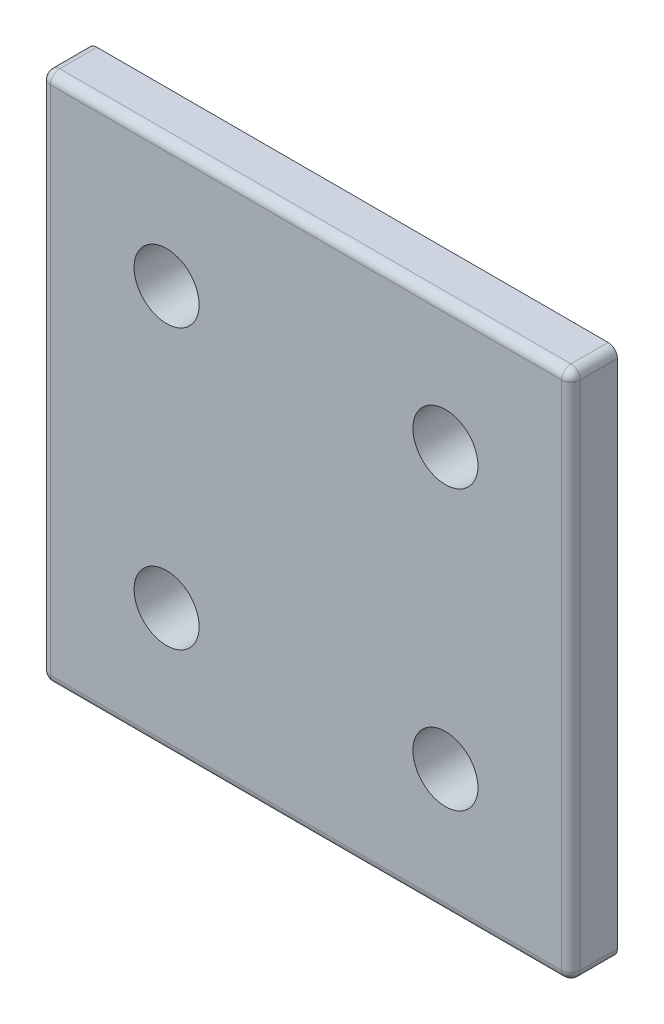
ISO-10303-21;
HEADER;
FILE_DESCRIPTION(('STEP AP214'),'2;1');
FILE_NAME('part.step','',(''),(''),'','','');
FILE_SCHEMA(('AUTOMOTIVE_DESIGN { 1 0 10303 214 1 1 1 1 }'));
ENDSEC;
DATA;
#1=APPLICATION_CONTEXT('core data for automotive mechanical design processes');
#2=APPLICATION_PROTOCOL_DEFINITION('international standard','automotive_design',2000,#1);
#3=PRODUCT_CONTEXT('',#1,'mechanical');
#4=PRODUCT('Part','Part','',(#3));
#5=PRODUCT_RELATED_PRODUCT_CATEGORY('part','',(#4));
#6=PRODUCT_DEFINITION_FORMATION('','',#4);
#7=PRODUCT_DEFINITION_CONTEXT('part definition',#1,'design');
#8=PRODUCT_DEFINITION('design','',#6,#7);
#9=PRODUCT_DEFINITION_SHAPE('','',#8);
#10=(LENGTH_UNIT() NAMED_UNIT(*) SI_UNIT(.MILLI.,.METRE.));
#11=(NAMED_UNIT(*) PLANE_ANGLE_UNIT() SI_UNIT($,.RADIAN.));
#12=(NAMED_UNIT(*) SI_UNIT($,.STERADIAN.) SOLID_ANGLE_UNIT());
#13=UNCERTAINTY_MEASURE_WITH_UNIT(LENGTH_MEASURE(1.E-05),#10,'distance_accuracy_value','');
#14=(GEOMETRIC_REPRESENTATION_CONTEXT(3) GLOBAL_UNCERTAINTY_ASSIGNED_CONTEXT((#13)) GLOBAL_UNIT_ASSIGNED_CONTEXT((#10,
#11,#12)) REPRESENTATION_CONTEXT('',''));
#15=CARTESIAN_POINT('',(0.,0.,0.));
#16=DIRECTION('',(0.,0.,1.));
#17=DIRECTION('',(1.,0.,0.));
#18=AXIS2_PLACEMENT_3D('',#15,#16,#17);
#19=CARTESIAN_POINT('',(0.,0.,2.5));
#20=DIRECTION('',(0.,0.,-1.));
#21=DIRECTION('',(-1.,0.,0.));
#22=AXIS2_PLACEMENT_3D('',#19,#20,#21);
#23=PLANE('',#22);
#24=DIRECTION('',(-1.,0.,0.));
#25=VECTOR('',#24,1.);
#26=CARTESIAN_POINT('',(0.,56.,2.5));
#27=LINE('',#26,#25);
#28=CARTESIAN_POINT('',(56.,56.,2.5));
#29=VERTEX_POINT('',#28);
#30=CARTESIAN_POINT('',(1.,56.,2.5));
#31=VERTEX_POINT('',#30);
#32=EDGE_CURVE('E284',#29,#31,#27,.T.);
#33=ORIENTED_EDGE('',*,*,#32,.T.);
#34=DIRECTION('',(0.,-1.,0.));
#35=VECTOR('',#34,1.);
#36=CARTESIAN_POINT('',(1.,0.,2.5));
#37=LINE('',#36,#35);
#38=CARTESIAN_POINT('',(1.,1.,2.5));
#39=VERTEX_POINT('',#38);
#40=EDGE_CURVE('E290',#31,#39,#37,.T.);
#41=ORIENTED_EDGE('',*,*,#40,.T.);
#42=DIRECTION('',(1.,0.,0.));
#43=VECTOR('',#42,1.);
#44=CARTESIAN_POINT('',(0.,1.,2.5));
#45=LINE('',#44,#43);
#46=CARTESIAN_POINT('',(56.,1.,2.5));
#47=VERTEX_POINT('',#46);
#48=EDGE_CURVE('E288',#39,#47,#45,.T.);
#49=ORIENTED_EDGE('',*,*,#48,.T.);
#50=DIRECTION('',(0.,1.,0.));
#51=VECTOR('',#50,1.);
#52=CARTESIAN_POINT('',(56.,0.,2.5));
#53=LINE('',#52,#51);
#54=EDGE_CURVE('E286',#47,#29,#53,.T.);
#55=ORIENTED_EDGE('',*,*,#54,.T.);
#56=EDGE_LOOP('',(#33,#41,#49,#55));
#57=FACE_BOUND('',#56,.T.);
#58=CARTESIAN_POINT('',(13.5,43.5,2.5));
#59=DIRECTION('',(0.,0.,1.));
#60=DIRECTION('',(1.,0.,0.));
#61=AXIS2_PLACEMENT_3D('',#58,#59,#60);
#62=CIRCLE('',#61,3.5);
#63=CARTESIAN_POINT('',(17.,43.5,2.5));
#64=VERTEX_POINT('',#63);
#65=EDGE_CURVE('E347',#64,#64,#62,.T.);
#66=ORIENTED_EDGE('',*,*,#65,.F.);
#67=EDGE_LOOP('',(#66));
#68=FACE_BOUND('',#67,.T.);
#69=CARTESIAN_POINT('',(13.5,13.5,2.5));
#70=DIRECTION('',(0.,0.,1.));
#71=DIRECTION('',(1.,0.,0.));
#72=AXIS2_PLACEMENT_3D('',#69,#70,#71);
#73=CIRCLE('',#72,3.5);
#74=CARTESIAN_POINT('',(17.,13.5,2.5));
#75=VERTEX_POINT('',#74);
#76=EDGE_CURVE('E260',#75,#75,#73,.T.);
#77=ORIENTED_EDGE('',*,*,#76,.F.);
#78=EDGE_LOOP('',(#77));
#79=FACE_BOUND('',#78,.T.);
#80=CARTESIAN_POINT('',(43.5,13.5,2.5));
#81=DIRECTION('',(0.,0.,1.));
#82=DIRECTION('',(1.,0.,0.));
#83=AXIS2_PLACEMENT_3D('',#80,#81,#82);
#84=CIRCLE('',#83,3.5);
#85=CARTESIAN_POINT('',(47.,13.5,2.5));
#86=VERTEX_POINT('',#85);
#87=EDGE_CURVE('E353',#86,#86,#84,.T.);
#88=ORIENTED_EDGE('',*,*,#87,.F.);
#89=EDGE_LOOP('',(#88));
#90=FACE_BOUND('',#89,.T.);
#91=CARTESIAN_POINT('',(43.5,43.5,2.5));
#92=DIRECTION('',(0.,0.,1.));
#93=DIRECTION('',(1.,0.,0.));
#94=AXIS2_PLACEMENT_3D('',#91,#92,#93);
#95=CIRCLE('',#94,3.5);
#96=CARTESIAN_POINT('',(47.,43.5,2.5));
#97=VERTEX_POINT('',#96);
#98=EDGE_CURVE('E339',#97,#97,#95,.T.);
#99=ORIENTED_EDGE('',*,*,#98,.F.);
#100=EDGE_LOOP('',(#99));
#101=FACE_BOUND('',#100,.T.);
#102=ADVANCED_FACE('F156',(#57,#68,#79,#90,#101),#23,.F.);
#103=CARTESIAN_POINT('',(0.,0.,-2.5));
#104=DIRECTION('',(0.,0.,-1.));
#105=DIRECTION('',(-1.,0.,0.));
#106=AXIS2_PLACEMENT_3D('',#103,#104,#105);
#107=PLANE('',#106);
#108=CARTESIAN_POINT('',(13.5,43.5,-2.5));
#109=DIRECTION('',(0.,0.,1.));
#110=DIRECTION('',(1.,0.,0.));
#111=AXIS2_PLACEMENT_3D('',#108,#109,#110);
#112=CIRCLE('',#111,3.5);
#113=CARTESIAN_POINT('',(17.,43.5,-2.5));
#114=VERTEX_POINT('',#113);
#115=EDGE_CURVE('E344',#114,#114,#112,.T.);
#116=ORIENTED_EDGE('',*,*,#115,.T.);
#117=EDGE_LOOP('',(#116));
#118=FACE_BOUND('',#117,.T.);
#119=CARTESIAN_POINT('',(13.5,13.5,-2.5));
#120=DIRECTION('',(0.,0.,1.));
#121=DIRECTION('',(1.,0.,0.));
#122=AXIS2_PLACEMENT_3D('',#119,#120,#121);
#123=CIRCLE('',#122,3.5);
#124=CARTESIAN_POINT('',(17.,13.5,-2.5));
#125=VERTEX_POINT('',#124);
#126=EDGE_CURVE('E266',#125,#125,#123,.T.);
#127=ORIENTED_EDGE('',*,*,#126,.T.);
#128=EDGE_LOOP('',(#127));
#129=FACE_BOUND('',#128,.T.);
#130=DIRECTION('',(1.,0.,0.));
#131=VECTOR('',#130,1.);
#132=CARTESIAN_POINT('',(57.,0.,-2.5));
#133=LINE('',#132,#131);
#134=CARTESIAN_POINT('',(1.00000000000001,0.,-2.5));
#135=VERTEX_POINT('',#134);
#136=CARTESIAN_POINT('',(56.,0.,-2.5));
#137=VERTEX_POINT('',#136);
#138=EDGE_CURVE('E248',#135,#137,#133,.T.);
#139=ORIENTED_EDGE('',*,*,#138,.F.);
#140=CARTESIAN_POINT('',(1.,1.,-2.5));
#141=DIRECTION('',(0.,0.,-1.));
#142=DIRECTION('',(-1.,0.,0.));
#143=AXIS2_PLACEMENT_3D('',#140,#141,#142);
#144=CIRCLE('',#143,1.);
#145=CARTESIAN_POINT('',(0.,1.,-2.5));
#146=VERTEX_POINT('',#145);
#147=EDGE_CURVE('E232',#135,#146,#144,.T.);
#148=ORIENTED_EDGE('',*,*,#147,.T.);
#149=DIRECTION('',(0.,-1.,0.));
#150=VECTOR('',#149,1.);
#151=CARTESIAN_POINT('',(0.,0.,-2.5));
#152=LINE('',#151,#150);
#153=CARTESIAN_POINT('',(0.,56.,-2.5));
#154=VERTEX_POINT('',#153);
#155=EDGE_CURVE('E271',#154,#146,#152,.T.);
#156=ORIENTED_EDGE('',*,*,#155,.F.);
#157=CARTESIAN_POINT('',(1.,56.,-2.5));
#158=DIRECTION('',(0.,0.,-1.));
#159=DIRECTION('',(-1.,0.,0.));
#160=AXIS2_PLACEMENT_3D('',#157,#158,#159);
#161=CIRCLE('',#160,1.);
#162=CARTESIAN_POINT('',(1.,57.,-2.5));
#163=VERTEX_POINT('',#162);
#164=EDGE_CURVE('E253',#154,#163,#161,.T.);
#165=ORIENTED_EDGE('',*,*,#164,.T.);
#166=DIRECTION('',(-1.,0.,0.));
#167=VECTOR('',#166,1.);
#168=CARTESIAN_POINT('',(57.,57.,-2.5));
#169=LINE('',#168,#167);
#170=CARTESIAN_POINT('',(56.,57.,-2.5));
#171=VERTEX_POINT('',#170);
#172=EDGE_CURVE('E263',#171,#163,#169,.T.);
#173=ORIENTED_EDGE('',*,*,#172,.F.);
#174=CARTESIAN_POINT('',(56.,56.,-2.5));
#175=DIRECTION('',(0.,0.,-1.));
#176=DIRECTION('',(-1.,0.,0.));
#177=AXIS2_PLACEMENT_3D('',#174,#175,#176);
#178=CIRCLE('',#177,1.);
#179=CARTESIAN_POINT('',(57.,56.,-2.5));
#180=VERTEX_POINT('',#179);
#181=EDGE_CURVE('E277',#171,#180,#178,.T.);
#182=ORIENTED_EDGE('',*,*,#181,.T.);
#183=DIRECTION('',(0.,1.,0.));
#184=VECTOR('',#183,1.);
#185=CARTESIAN_POINT('',(57.,57.,-2.5));
#186=LINE('',#185,#184);
#187=CARTESIAN_POINT('',(57.,1.,-2.5));
#188=VERTEX_POINT('',#187);
#189=EDGE_CURVE('E259',#188,#180,#186,.T.);
#190=ORIENTED_EDGE('',*,*,#189,.F.);
#191=CARTESIAN_POINT('',(56.,1.,-2.5));
#192=DIRECTION('',(0.,0.,-1.));
#193=DIRECTION('',(-1.,0.,0.));
#194=AXIS2_PLACEMENT_3D('',#191,#192,#193);
#195=CIRCLE('',#194,1.);
#196=EDGE_CURVE('E243',#188,#137,#195,.T.);
#197=ORIENTED_EDGE('',*,*,#196,.T.);
#198=EDGE_LOOP('',(#139,#148,#156,#165,#173,#182,#190,#197));
#199=FACE_BOUND('',#198,.T.);
#200=CARTESIAN_POINT('',(43.5,13.5,-2.5));
#201=DIRECTION('',(0.,0.,1.));
#202=DIRECTION('',(1.,0.,0.));
#203=AXIS2_PLACEMENT_3D('',#200,#201,#202);
#204=CIRCLE('',#203,3.5);
#205=CARTESIAN_POINT('',(47.,13.5,-2.5));
#206=VERTEX_POINT('',#205);
#207=EDGE_CURVE('E350',#206,#206,#204,.T.);
#208=ORIENTED_EDGE('',*,*,#207,.T.);
#209=EDGE_LOOP('',(#208));
#210=FACE_BOUND('',#209,.T.);
#211=CARTESIAN_POINT('',(43.5,43.5,-2.5));
#212=DIRECTION('',(0.,0.,1.));
#213=DIRECTION('',(1.,0.,0.));
#214=AXIS2_PLACEMENT_3D('',#211,#212,#213);
#215=CIRCLE('',#214,3.5);
#216=CARTESIAN_POINT('',(47.,43.5,-2.5));
#217=VERTEX_POINT('',#216);
#218=EDGE_CURVE('E334',#217,#217,#215,.T.);
#219=ORIENTED_EDGE('',*,*,#218,.T.);
#220=EDGE_LOOP('',(#219));
#221=FACE_BOUND('',#220,.T.);
#222=ADVANCED_FACE('F255',(#118,#129,#199,#210,#221),#107,.T.);
#223=CARTESIAN_POINT('',(57.,0.,2.5));
#224=DIRECTION('',(0.,1.,0.));
#225=DIRECTION('',(-1.,0.,0.));
#226=AXIS2_PLACEMENT_3D('',#223,#224,#225);
#227=PLANE('',#226);
#228=DIRECTION('',(1.,0.,0.));
#229=VECTOR('',#228,1.);
#230=CARTESIAN_POINT('',(57.,0.,1.5));
#231=LINE('',#230,#229);
#232=CARTESIAN_POINT('',(56.,0.,1.5));
#233=VERTEX_POINT('',#232);
#234=CARTESIAN_POINT('',(1.,0.,1.5));
#235=VERTEX_POINT('',#234);
#236=EDGE_CURVE('E251',#233,#235,#231,.F.);
#237=ORIENTED_EDGE('',*,*,#236,.T.);
#238=DIRECTION('',(0.,0.,-1.));
#239=VECTOR('',#238,1.);
#240=CARTESIAN_POINT('',(1.,0.,2.5));
#241=LINE('',#240,#239);
#242=EDGE_CURVE('E236',#235,#135,#241,.T.);
#243=ORIENTED_EDGE('',*,*,#242,.T.);
#244=ORIENTED_EDGE('',*,*,#138,.T.);
#245=DIRECTION('',(0.,0.,-1.));
#246=VECTOR('',#245,1.);
#247=CARTESIAN_POINT('',(56.,0.,2.5));
#248=LINE('',#247,#246);
#249=EDGE_CURVE('E273',#137,#233,#248,.F.);
#250=ORIENTED_EDGE('',*,*,#249,.T.);
#251=EDGE_LOOP('',(#237,#243,#244,#250));
#252=FACE_BOUND('',#251,.T.);
#253=ADVANCED_FACE('F247',(#252),#227,.F.);
#254=CARTESIAN_POINT('',(57.,57.,2.5));
#255=DIRECTION('',(-1.,0.,0.));
#256=DIRECTION('',(0.,-1.,0.));
#257=AXIS2_PLACEMENT_3D('',#254,#255,#256);
#258=PLANE('',#257);
#259=DIRECTION('',(0.,1.,0.));
#260=VECTOR('',#259,1.);
#261=CARTESIAN_POINT('',(57.,57.,1.5));
#262=LINE('',#261,#260);
#263=CARTESIAN_POINT('',(57.,56.,1.5));
#264=VERTEX_POINT('',#263);
#265=CARTESIAN_POINT('',(57.,1.,1.5));
#266=VERTEX_POINT('',#265);
#267=EDGE_CURVE('E295',#264,#266,#262,.F.);
#268=ORIENTED_EDGE('',*,*,#267,.T.);
#269=DIRECTION('',(0.,0.,-1.));
#270=VECTOR('',#269,1.);
#271=CARTESIAN_POINT('',(57.,1.,2.5));
#272=LINE('',#271,#270);
#273=EDGE_CURVE('E297',#266,#188,#272,.T.);
#274=ORIENTED_EDGE('',*,*,#273,.T.);
#275=ORIENTED_EDGE('',*,*,#189,.T.);
#276=DIRECTION('',(0.,0.,-1.));
#277=VECTOR('',#276,1.);
#278=CARTESIAN_POINT('',(57.,56.,2.5));
#279=LINE('',#278,#277);
#280=EDGE_CURVE('E293',#180,#264,#279,.F.);
#281=ORIENTED_EDGE('',*,*,#280,.T.);
#282=EDGE_LOOP('',(#268,#274,#275,#281));
#283=FACE_BOUND('',#282,.T.);
#284=ADVANCED_FACE('F391',(#283),#258,.F.);
#285=CARTESIAN_POINT('',(57.,57.,2.5));
#286=DIRECTION('',(0.,-1.,0.));
#287=DIRECTION('',(1.,0.,0.));
#288=AXIS2_PLACEMENT_3D('',#285,#286,#287);
#289=PLANE('',#288);
#290=DIRECTION('',(-1.,0.,0.));
#291=VECTOR('',#290,1.);
#292=CARTESIAN_POINT('',(57.,57.,1.5));
#293=LINE('',#292,#291);
#294=CARTESIAN_POINT('',(1.,57.,1.5));
#295=VERTEX_POINT('',#294);
#296=CARTESIAN_POINT('',(56.,57.,1.5));
#297=VERTEX_POINT('',#296);
#298=EDGE_CURVE('E165',#295,#297,#293,.F.);
#299=ORIENTED_EDGE('',*,*,#298,.T.);
#300=DIRECTION('',(0.,0.,-1.));
#301=VECTOR('',#300,1.);
#302=CARTESIAN_POINT('',(56.,57.,2.5));
#303=LINE('',#302,#301);
#304=EDGE_CURVE('E12',#297,#171,#303,.T.);
#305=ORIENTED_EDGE('',*,*,#304,.T.);
#306=ORIENTED_EDGE('',*,*,#172,.T.);
#307=DIRECTION('',(0.,0.,-1.));
#308=VECTOR('',#307,1.);
#309=CARTESIAN_POINT('',(1.,57.,2.5));
#310=LINE('',#309,#308);
#311=EDGE_CURVE('E176',#163,#295,#310,.F.);
#312=ORIENTED_EDGE('',*,*,#311,.T.);
#313=EDGE_LOOP('',(#299,#305,#306,#312));
#314=FACE_BOUND('',#313,.T.);
#315=ADVANCED_FACE('F387',(#314),#289,.F.);
#316=CARTESIAN_POINT('',(0.,0.,2.5));
#317=DIRECTION('',(1.,0.,0.));
#318=DIRECTION('',(0.,0.,-1.));
#319=AXIS2_PLACEMENT_3D('',#316,#317,#318);
#320=PLANE('',#319);
#321=ORIENTED_EDGE('',*,*,#155,.T.);
#322=DIRECTION('',(0.,0.,-1.));
#323=VECTOR('',#322,1.);
#324=CARTESIAN_POINT('',(0.,1.,2.5));
#325=LINE('',#324,#323);
#326=CARTESIAN_POINT('',(0.,1.,1.5));
#327=VERTEX_POINT('',#326);
#328=EDGE_CURVE('E237',#146,#327,#325,.F.);
#329=ORIENTED_EDGE('',*,*,#328,.T.);
#330=DIRECTION('',(0.,-1.,0.));
#331=VECTOR('',#330,1.);
#332=CARTESIAN_POINT('',(0.,0.,1.5));
#333=LINE('',#332,#331);
#334=CARTESIAN_POINT('',(0.,56.,1.5));
#335=VERTEX_POINT('',#334);
#336=EDGE_CURVE('E281',#327,#335,#333,.F.);
#337=ORIENTED_EDGE('',*,*,#336,.T.);
#338=DIRECTION('',(0.,0.,-1.));
#339=VECTOR('',#338,1.);
#340=CARTESIAN_POINT('',(0.,56.,2.5));
#341=LINE('',#340,#339);
#342=EDGE_CURVE('E242',#335,#154,#341,.T.);
#343=ORIENTED_EDGE('',*,*,#342,.T.);
#344=EDGE_LOOP('',(#321,#329,#337,#343));
#345=FACE_BOUND('',#344,.T.);
#346=ADVANCED_FACE('F372',(#345),#320,.F.);
#347=CARTESIAN_POINT('',(13.5,13.5,2.5));
#348=DIRECTION('',(0.,0.,-1.));
#349=DIRECTION('',(-1.,0.,0.));
#350=AXIS2_PLACEMENT_3D('',#347,#348,#349);
#351=CYLINDRICAL_SURFACE('',#350,3.5);
#352=ORIENTED_EDGE('',*,*,#76,.T.);
#353=EDGE_LOOP('',(#352));
#354=FACE_BOUND('',#353,.T.);
#355=ORIENTED_EDGE('',*,*,#126,.F.);
#356=EDGE_LOOP('',(#355));
#357=FACE_BOUND('',#356,.T.);
#358=ADVANCED_FACE('F362',(#354,#357),#351,.F.);
#359=CARTESIAN_POINT('',(43.5,13.5,2.5));
#360=DIRECTION('',(0.,0.,-1.));
#361=DIRECTION('',(-1.,0.,0.));
#362=AXIS2_PLACEMENT_3D('',#359,#360,#361);
#363=CYLINDRICAL_SURFACE('',#362,3.5);
#364=ORIENTED_EDGE('',*,*,#87,.T.);
#365=EDGE_LOOP('',(#364));
#366=FACE_BOUND('',#365,.T.);
#367=ORIENTED_EDGE('',*,*,#207,.F.);
#368=EDGE_LOOP('',(#367));
#369=FACE_BOUND('',#368,.T.);
#370=ADVANCED_FACE('F359',(#366,#369),#363,.F.);
#371=CARTESIAN_POINT('',(13.5,43.5,2.5));
#372=DIRECTION('',(0.,0.,-1.));
#373=DIRECTION('',(-1.,0.,0.));
#374=AXIS2_PLACEMENT_3D('',#371,#372,#373);
#375=CYLINDRICAL_SURFACE('',#374,3.5);
#376=ORIENTED_EDGE('',*,*,#65,.T.);
#377=EDGE_LOOP('',(#376));
#378=FACE_BOUND('',#377,.T.);
#379=ORIENTED_EDGE('',*,*,#115,.F.);
#380=EDGE_LOOP('',(#379));
#381=FACE_BOUND('',#380,.T.);
#382=ADVANCED_FACE('F361',(#378,#381),#375,.F.);
#383=CARTESIAN_POINT('',(43.5,43.5,2.5));
#384=DIRECTION('',(0.,0.,-1.));
#385=DIRECTION('',(-1.,0.,0.));
#386=AXIS2_PLACEMENT_3D('',#383,#384,#385);
#387=CYLINDRICAL_SURFACE('',#386,3.5);
#388=ORIENTED_EDGE('',*,*,#98,.T.);
#389=EDGE_LOOP('',(#388));
#390=FACE_BOUND('',#389,.T.);
#391=ORIENTED_EDGE('',*,*,#218,.F.);
#392=EDGE_LOOP('',(#391));
#393=FACE_BOUND('',#392,.T.);
#394=ADVANCED_FACE('F369',(#390,#393),#387,.F.);
#395=CARTESIAN_POINT('',(56.,56.,2.5));
#396=DIRECTION('',(0.,0.,-1.));
#397=DIRECTION('',(-1.,0.,0.));
#398=AXIS2_PLACEMENT_3D('',#395,#396,#397);
#399=CYLINDRICAL_SURFACE('',#398,1.);
#400=CARTESIAN_POINT('',(56.,56.,1.5));
#401=DIRECTION('',(0.,0.,1.));
#402=DIRECTION('',(1.,0.,0.));
#403=AXIS2_PLACEMENT_3D('',#400,#401,#402);
#404=CIRCLE('',#403,1.);
#405=EDGE_CURVE('E160',#264,#297,#404,.T.);
#406=ORIENTED_EDGE('',*,*,#405,.F.);
#407=ORIENTED_EDGE('',*,*,#280,.F.);
#408=ORIENTED_EDGE('',*,*,#181,.F.);
#409=ORIENTED_EDGE('',*,*,#304,.F.);
#410=EDGE_LOOP('',(#406,#407,#408,#409));
#411=FACE_BOUND('',#410,.T.);
#412=ADVANCED_FACE('F158',(#411),#399,.T.);
#413=CARTESIAN_POINT('',(56.,56.,1.5));
#414=DIRECTION('',(0.,0.,1.));
#415=DIRECTION('',(1.,0.,0.));
#416=AXIS2_PLACEMENT_3D('',#413,#414,#415);
#417=SPHERICAL_SURFACE('',#416,1.);
#418=CARTESIAN_POINT('',(56.,56.,1.5));
#419=DIRECTION('',(0.,1.,0.));
#420=DIRECTION('',(0.,0.,1.));
#421=AXIS2_PLACEMENT_3D('',#418,#419,#420);
#422=CIRCLE('',#421,1.);
#423=EDGE_CURVE('E326',#264,#29,#422,.F.);
#424=ORIENTED_EDGE('',*,*,#423,.F.);
#425=ORIENTED_EDGE('',*,*,#405,.T.);
#426=CARTESIAN_POINT('',(56.,56.,1.5));
#427=DIRECTION('',(1.,0.,0.));
#428=DIRECTION('',(0.,0.,-1.));
#429=AXIS2_PLACEMENT_3D('',#426,#427,#428);
#430=CIRCLE('',#429,1.);
#431=EDGE_CURVE('E328',#29,#297,#430,.F.);
#432=ORIENTED_EDGE('',*,*,#431,.F.);
#433=EDGE_LOOP('',(#424,#425,#432));
#434=FACE_BOUND('',#433,.T.);
#435=ADVANCED_FACE('F432',(#434),#417,.T.);
#436=CARTESIAN_POINT('',(1.,56.,2.5));
#437=DIRECTION('',(0.,0.,-1.));
#438=DIRECTION('',(-1.,0.,0.));
#439=AXIS2_PLACEMENT_3D('',#436,#437,#438);
#440=CYLINDRICAL_SURFACE('',#439,1.);
#441=ORIENTED_EDGE('',*,*,#164,.F.);
#442=ORIENTED_EDGE('',*,*,#342,.F.);
#443=CARTESIAN_POINT('',(1.,56.,1.5));
#444=DIRECTION('',(0.,0.,1.));
#445=DIRECTION('',(1.,0.,0.));
#446=AXIS2_PLACEMENT_3D('',#443,#444,#445);
#447=CIRCLE('',#446,1.);
#448=EDGE_CURVE('E323',#295,#335,#447,.T.);
#449=ORIENTED_EDGE('',*,*,#448,.F.);
#450=ORIENTED_EDGE('',*,*,#311,.F.);
#451=EDGE_LOOP('',(#441,#442,#449,#450));
#452=FACE_BOUND('',#451,.T.);
#453=ADVANCED_FACE('F430',(#452),#440,.T.);
#454=CARTESIAN_POINT('',(0.,56.,1.5));
#455=DIRECTION('',(-1.,0.,0.));
#456=DIRECTION('',(0.,-1.,0.));
#457=AXIS2_PLACEMENT_3D('',#454,#455,#456);
#458=CYLINDRICAL_SURFACE('',#457,1.);
#459=ORIENTED_EDGE('',*,*,#431,.T.);
#460=ORIENTED_EDGE('',*,*,#298,.F.);
#461=CARTESIAN_POINT('',(1.,56.,1.5));
#462=DIRECTION('',(-1.,0.,0.));
#463=DIRECTION('',(0.,-1.,0.));
#464=AXIS2_PLACEMENT_3D('',#461,#462,#463);
#465=CIRCLE('',#464,1.);
#466=EDGE_CURVE('E320',#31,#295,#465,.T.);
#467=ORIENTED_EDGE('',*,*,#466,.F.);
#468=ORIENTED_EDGE('',*,*,#32,.F.);
#469=EDGE_LOOP('',(#459,#460,#467,#468));
#470=FACE_BOUND('',#469,.T.);
#471=ADVANCED_FACE('F426',(#470),#458,.T.);
#472=CARTESIAN_POINT('',(56.,0.,1.5));
#473=DIRECTION('',(0.,1.,0.));
#474=DIRECTION('',(-1.,0.,0.));
#475=AXIS2_PLACEMENT_3D('',#472,#473,#474);
#476=CYLINDRICAL_SURFACE('',#475,1.);
#477=ORIENTED_EDGE('',*,*,#423,.T.);
#478=ORIENTED_EDGE('',*,*,#54,.F.);
#479=CARTESIAN_POINT('',(56.,1.,1.5));
#480=DIRECTION('',(0.,-1.,0.));
#481=DIRECTION('',(0.,0.,-1.));
#482=AXIS2_PLACEMENT_3D('',#479,#480,#481);
#483=CIRCLE('',#482,1.);
#484=EDGE_CURVE('E317',#266,#47,#483,.T.);
#485=ORIENTED_EDGE('',*,*,#484,.F.);
#486=ORIENTED_EDGE('',*,*,#267,.F.);
#487=EDGE_LOOP('',(#477,#478,#485,#486));
#488=FACE_BOUND('',#487,.T.);
#489=ADVANCED_FACE('F422',(#488),#476,.T.);
#490=CARTESIAN_POINT('',(56.,1.,2.5));
#491=DIRECTION('',(0.,0.,-1.));
#492=DIRECTION('',(-1.,0.,0.));
#493=AXIS2_PLACEMENT_3D('',#490,#491,#492);
#494=CYLINDRICAL_SURFACE('',#493,1.);
#495=ORIENTED_EDGE('',*,*,#196,.F.);
#496=ORIENTED_EDGE('',*,*,#273,.F.);
#497=CARTESIAN_POINT('',(56.,1.,1.5));
#498=DIRECTION('',(0.,0.,1.));
#499=DIRECTION('',(1.,0.,0.));
#500=AXIS2_PLACEMENT_3D('',#497,#498,#499);
#501=CIRCLE('',#500,1.);
#502=EDGE_CURVE('E314',#233,#266,#501,.T.);
#503=ORIENTED_EDGE('',*,*,#502,.F.);
#504=ORIENTED_EDGE('',*,*,#249,.F.);
#505=EDGE_LOOP('',(#495,#496,#503,#504));
#506=FACE_BOUND('',#505,.T.);
#507=ADVANCED_FACE('F418',(#506),#494,.T.);
#508=CARTESIAN_POINT('',(1.,56.,1.5));
#509=DIRECTION('',(0.,0.,1.));
#510=DIRECTION('',(1.,0.,0.));
#511=AXIS2_PLACEMENT_3D('',#508,#509,#510);
#512=SPHERICAL_SURFACE('',#511,1.);
#513=ORIENTED_EDGE('',*,*,#466,.T.);
#514=ORIENTED_EDGE('',*,*,#448,.T.);
#515=CARTESIAN_POINT('',(1.,56.,1.5));
#516=DIRECTION('',(0.,1.,0.));
#517=DIRECTION('',(0.,0.,1.));
#518=AXIS2_PLACEMENT_3D('',#515,#516,#517);
#519=CIRCLE('',#518,1.);
#520=EDGE_CURVE('E311',#31,#335,#519,.F.);
#521=ORIENTED_EDGE('',*,*,#520,.F.);
#522=EDGE_LOOP('',(#513,#514,#521));
#523=FACE_BOUND('',#522,.T.);
#524=ADVANCED_FACE('F414',(#523),#512,.T.);
#525=CARTESIAN_POINT('',(56.,1.,1.5));
#526=DIRECTION('',(0.,0.,1.));
#527=DIRECTION('',(1.,0.,0.));
#528=AXIS2_PLACEMENT_3D('',#525,#526,#527);
#529=SPHERICAL_SURFACE('',#528,1.);
#530=ORIENTED_EDGE('',*,*,#502,.T.);
#531=ORIENTED_EDGE('',*,*,#484,.T.);
#532=CARTESIAN_POINT('',(56.,1.,1.5));
#533=DIRECTION('',(1.,0.,0.));
#534=DIRECTION('',(0.,0.,-1.));
#535=AXIS2_PLACEMENT_3D('',#532,#533,#534);
#536=CIRCLE('',#535,1.);
#537=EDGE_CURVE('E308',#233,#47,#536,.F.);
#538=ORIENTED_EDGE('',*,*,#537,.F.);
#539=EDGE_LOOP('',(#530,#531,#538));
#540=FACE_BOUND('',#539,.T.);
#541=ADVANCED_FACE('F410',(#540),#529,.T.);
#542=CARTESIAN_POINT('',(1.,0.,1.5));
#543=DIRECTION('',(0.,-1.,0.));
#544=DIRECTION('',(0.,0.,-1.));
#545=AXIS2_PLACEMENT_3D('',#542,#543,#544);
#546=CYLINDRICAL_SURFACE('',#545,1.);
#547=ORIENTED_EDGE('',*,*,#520,.T.);
#548=ORIENTED_EDGE('',*,*,#336,.F.);
#549=CARTESIAN_POINT('',(1.,1.,1.5));
#550=DIRECTION('',(0.,-1.,0.));
#551=DIRECTION('',(0.,0.,-1.));
#552=AXIS2_PLACEMENT_3D('',#549,#550,#551);
#553=CIRCLE('',#552,1.);
#554=EDGE_CURVE('E305',#39,#327,#553,.T.);
#555=ORIENTED_EDGE('',*,*,#554,.F.);
#556=ORIENTED_EDGE('',*,*,#40,.F.);
#557=EDGE_LOOP('',(#547,#548,#555,#556));
#558=FACE_BOUND('',#557,.T.);
#559=ADVANCED_FACE('F406',(#558),#546,.T.);
#560=CARTESIAN_POINT('',(0.,1.,1.5));
#561=DIRECTION('',(1.,0.,0.));
#562=DIRECTION('',(0.,1.,0.));
#563=AXIS2_PLACEMENT_3D('',#560,#561,#562);
#564=CYLINDRICAL_SURFACE('',#563,1.);
#565=ORIENTED_EDGE('',*,*,#537,.T.);
#566=ORIENTED_EDGE('',*,*,#48,.F.);
#567=CARTESIAN_POINT('',(1.,1.,1.5));
#568=DIRECTION('',(-1.,0.,0.));
#569=DIRECTION('',(0.,0.,1.));
#570=AXIS2_PLACEMENT_3D('',#567,#568,#569);
#571=CIRCLE('',#570,1.);
#572=EDGE_CURVE('E303',#235,#39,#571,.T.);
#573=ORIENTED_EDGE('',*,*,#572,.F.);
#574=ORIENTED_EDGE('',*,*,#236,.F.);
#575=EDGE_LOOP('',(#565,#566,#573,#574));
#576=FACE_BOUND('',#575,.T.);
#577=ADVANCED_FACE('F402',(#576),#564,.T.);
#578=CARTESIAN_POINT('',(1.,1.,1.5));
#579=DIRECTION('',(0.,0.,1.));
#580=DIRECTION('',(1.,0.,0.));
#581=AXIS2_PLACEMENT_3D('',#578,#579,#580);
#582=SPHERICAL_SURFACE('',#581,1.);
#583=ORIENTED_EDGE('',*,*,#572,.T.);
#584=ORIENTED_EDGE('',*,*,#554,.T.);
#585=CARTESIAN_POINT('',(1.,1.,1.5));
#586=DIRECTION('',(0.,0.,1.));
#587=DIRECTION('',(1.,0.,0.));
#588=AXIS2_PLACEMENT_3D('',#585,#586,#587);
#589=CIRCLE('',#588,1.);
#590=EDGE_CURVE('E301',#235,#327,#589,.F.);
#591=ORIENTED_EDGE('',*,*,#590,.F.);
#592=EDGE_LOOP('',(#583,#584,#591));
#593=FACE_BOUND('',#592,.T.);
#594=ADVANCED_FACE('F399',(#593),#582,.T.);
#595=CARTESIAN_POINT('',(1.,1.,2.5));
#596=DIRECTION('',(0.,0.,-1.));
#597=DIRECTION('',(-1.,0.,0.));
#598=AXIS2_PLACEMENT_3D('',#595,#596,#597);
#599=CYLINDRICAL_SURFACE('',#598,1.);
#600=ORIENTED_EDGE('',*,*,#590,.T.);
#601=ORIENTED_EDGE('',*,*,#328,.F.);
#602=ORIENTED_EDGE('',*,*,#147,.F.);
#603=ORIENTED_EDGE('',*,*,#242,.F.);
#604=EDGE_LOOP('',(#600,#601,#602,#603));
#605=FACE_BOUND('',#604,.T.);
#606=ADVANCED_FACE('F235',(#605),#599,.T.);
#607=CLOSED_SHELL('',(#102,#222,#253,#284,#315,#346,#358,#370,#382,#394,#412,#435,#453,#471,
#489,#507,#524,#541,#559,#577,#594,#606));
#608=MANIFOLD_SOLID_BREP('B2',#607);
#609=ADVANCED_BREP_SHAPE_REPRESENTATION('',(#18,#608),#14);
#610=SHAPE_DEFINITION_REPRESENTATION(#9,#609);
ENDSEC;
END-ISO-10303-21;
